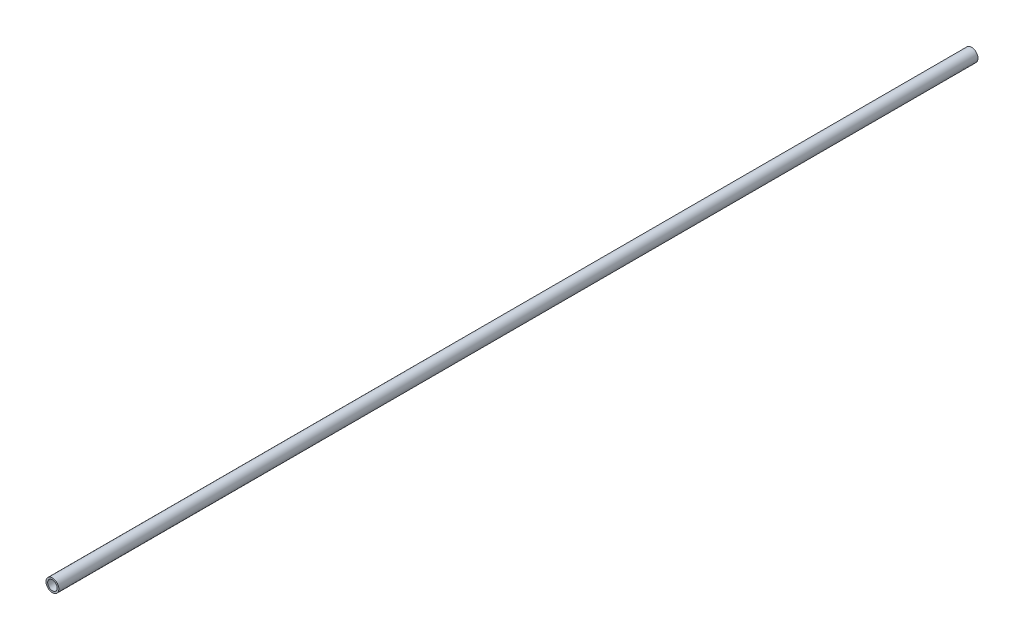
ISO-10303-21;
HEADER;
FILE_DESCRIPTION(('STEP AP214'),'2;1');
FILE_NAME('part.step','',(''),(''),'','','');
FILE_SCHEMA(('AUTOMOTIVE_DESIGN { 1 0 10303 214 1 1 1 1 }'));
ENDSEC;
DATA;
#1=APPLICATION_CONTEXT('core data for automotive mechanical design processes');
#2=APPLICATION_PROTOCOL_DEFINITION('international standard','automotive_design',2000,#1);
#3=PRODUCT_CONTEXT('',#1,'mechanical');
#4=PRODUCT('Part','Part','',(#3));
#5=PRODUCT_RELATED_PRODUCT_CATEGORY('part','',(#4));
#6=PRODUCT_DEFINITION_FORMATION('','',#4);
#7=PRODUCT_DEFINITION_CONTEXT('part definition',#1,'design');
#8=PRODUCT_DEFINITION('design','',#6,#7);
#9=PRODUCT_DEFINITION_SHAPE('','',#8);
#10=(LENGTH_UNIT() NAMED_UNIT(*) SI_UNIT(.MILLI.,.METRE.));
#11=(NAMED_UNIT(*) PLANE_ANGLE_UNIT() SI_UNIT($,.RADIAN.));
#12=(NAMED_UNIT(*) SI_UNIT($,.STERADIAN.) SOLID_ANGLE_UNIT());
#13=UNCERTAINTY_MEASURE_WITH_UNIT(LENGTH_MEASURE(1.E-05),#10,'distance_accuracy_value','');
#14=(GEOMETRIC_REPRESENTATION_CONTEXT(3) GLOBAL_UNCERTAINTY_ASSIGNED_CONTEXT((#13)) GLOBAL_UNIT_ASSIGNED_CONTEXT((#10,
#11,#12)) REPRESENTATION_CONTEXT('',''));
#15=CARTESIAN_POINT('',(0.,0.,0.));
#16=DIRECTION('',(0.,0.,1.));
#17=DIRECTION('',(1.,0.,0.));
#18=AXIS2_PLACEMENT_3D('',#15,#16,#17);
#19=CARTESIAN_POINT('',(0.,0.,762.));
#20=DIRECTION('',(0.,0.,1.));
#21=DIRECTION('',(1.,0.,0.));
#22=AXIS2_PLACEMENT_3D('',#19,#20,#21);
#23=PLANE('',#22);
#24=CARTESIAN_POINT('',(0.,0.,762.));
#25=DIRECTION('',(0.,0.,1.));
#26=DIRECTION('',(1.,0.,0.));
#27=AXIS2_PLACEMENT_3D('',#24,#25,#26);
#28=CIRCLE('',#27,10.668);
#29=CARTESIAN_POINT('',(10.668,0.,762.));
#30=VERTEX_POINT('',#29);
#31=EDGE_CURVE('E11',#30,#30,#28,.T.);
#32=ORIENTED_EDGE('',*,*,#31,.T.);
#33=EDGE_LOOP('',(#32));
#34=FACE_BOUND('',#33,.T.);
#35=CARTESIAN_POINT('',(0.,0.,762.));
#36=DIRECTION('',(0.,0.,1.));
#37=DIRECTION('',(1.,0.,0.));
#38=AXIS2_PLACEMENT_3D('',#35,#36,#37);
#39=CIRCLE('',#38,7.8994);
#40=CARTESIAN_POINT('',(7.8994,0.,762.));
#41=VERTEX_POINT('',#40);
#42=EDGE_CURVE('E47',#41,#41,#39,.T.);
#43=ORIENTED_EDGE('',*,*,#42,.F.);
#44=EDGE_LOOP('',(#43));
#45=FACE_BOUND('',#44,.T.);
#46=ADVANCED_FACE('F36',(#34,#45),#23,.T.);
#47=CARTESIAN_POINT('',(0.,0.,-762.));
#48=DIRECTION('',(0.,0.,1.));
#49=DIRECTION('',(1.,0.,0.));
#50=AXIS2_PLACEMENT_3D('',#47,#48,#49);
#51=PLANE('',#50);
#52=CARTESIAN_POINT('',(0.,0.,-762.));
#53=DIRECTION('',(0.,0.,1.));
#54=DIRECTION('',(1.,0.,0.));
#55=AXIS2_PLACEMENT_3D('',#52,#53,#54);
#56=CIRCLE('',#55,10.668);
#57=CARTESIAN_POINT('',(10.668,0.,-762.));
#58=VERTEX_POINT('',#57);
#59=EDGE_CURVE('E40',#58,#58,#56,.T.);
#60=ORIENTED_EDGE('',*,*,#59,.F.);
#61=EDGE_LOOP('',(#60));
#62=FACE_BOUND('',#61,.T.);
#63=CARTESIAN_POINT('',(0.,0.,-762.));
#64=DIRECTION('',(0.,0.,1.));
#65=DIRECTION('',(1.,0.,0.));
#66=AXIS2_PLACEMENT_3D('',#63,#64,#65);
#67=CIRCLE('',#66,7.8994);
#68=CARTESIAN_POINT('',(7.8994,0.,-762.));
#69=VERTEX_POINT('',#68);
#70=EDGE_CURVE('E49',#69,#69,#67,.T.);
#71=ORIENTED_EDGE('',*,*,#70,.T.);
#72=EDGE_LOOP('',(#71));
#73=FACE_BOUND('',#72,.T.);
#74=ADVANCED_FACE('F59',(#62,#73),#51,.F.);
#75=CARTESIAN_POINT('',(0.,0.,762.));
#76=DIRECTION('',(0.,0.,-1.));
#77=DIRECTION('',(-1.,0.,0.));
#78=AXIS2_PLACEMENT_3D('',#75,#76,#77);
#79=CYLINDRICAL_SURFACE('',#78,10.668);
#80=ORIENTED_EDGE('',*,*,#31,.F.);
#81=EDGE_LOOP('',(#80));
#82=FACE_BOUND('',#81,.T.);
#83=ORIENTED_EDGE('',*,*,#59,.T.);
#84=EDGE_LOOP('',(#83));
#85=FACE_BOUND('',#84,.T.);
#86=ADVANCED_FACE('F38',(#82,#85),#79,.T.);
#87=CARTESIAN_POINT('',(0.,0.,762.));
#88=DIRECTION('',(0.,0.,-1.));
#89=DIRECTION('',(-1.,0.,0.));
#90=AXIS2_PLACEMENT_3D('',#87,#88,#89);
#91=CYLINDRICAL_SURFACE('',#90,7.8994);
#92=ORIENTED_EDGE('',*,*,#42,.T.);
#93=EDGE_LOOP('',(#92));
#94=FACE_BOUND('',#93,.T.);
#95=ORIENTED_EDGE('',*,*,#70,.F.);
#96=EDGE_LOOP('',(#95));
#97=FACE_BOUND('',#96,.T.);
#98=ADVANCED_FACE('F55',(#94,#97),#91,.F.);
#99=CLOSED_SHELL('',(#46,#74,#86,#98));
#100=MANIFOLD_SOLID_BREP('B2',#99);
#101=ADVANCED_BREP_SHAPE_REPRESENTATION('',(#18,#100),#14);
#102=SHAPE_DEFINITION_REPRESENTATION(#9,#101);
ENDSEC;
END-ISO-10303-21;
